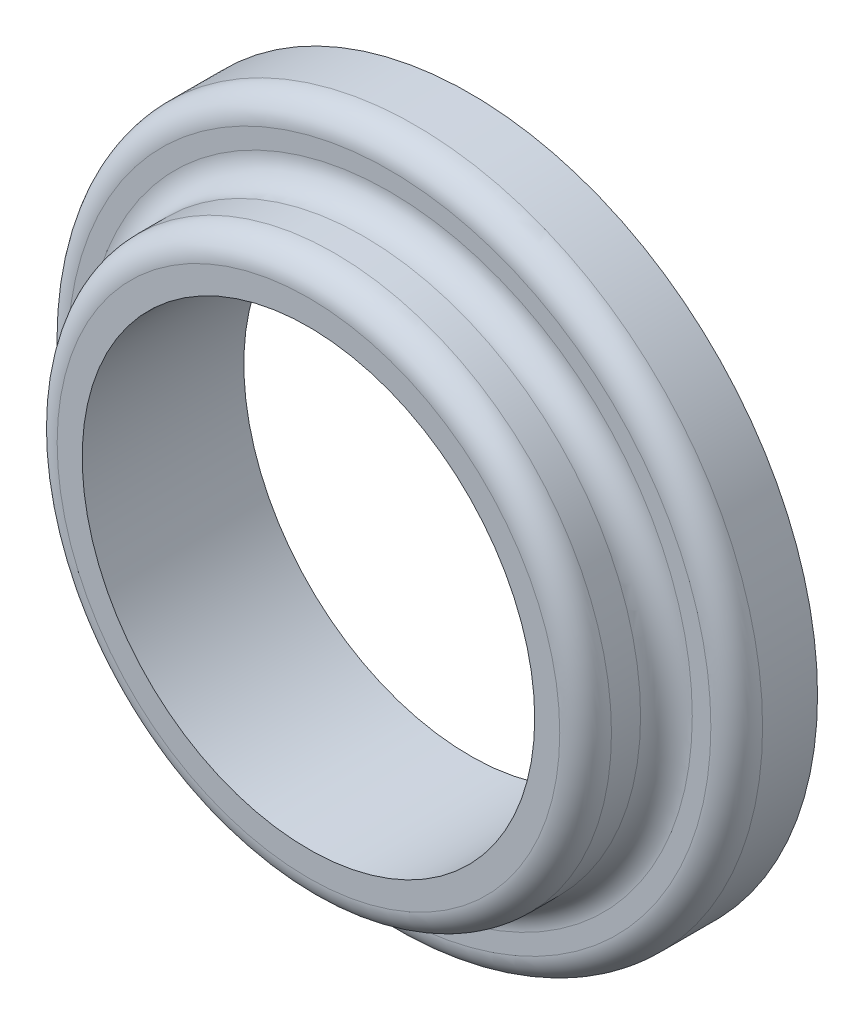
ISO-10303-21;
HEADER;
FILE_DESCRIPTION(('STEP AP214'),'2;1');
FILE_NAME('part.step','',(''),(''),'','','');
FILE_SCHEMA(('AUTOMOTIVE_DESIGN { 1 0 10303 214 1 1 1 1 }'));
ENDSEC;
DATA;
#1=APPLICATION_CONTEXT('core data for automotive mechanical design processes');
#2=APPLICATION_PROTOCOL_DEFINITION('international standard','automotive_design',2000,#1);
#3=PRODUCT_CONTEXT('',#1,'mechanical');
#4=PRODUCT('Part','Part','',(#3));
#5=PRODUCT_RELATED_PRODUCT_CATEGORY('part','',(#4));
#6=PRODUCT_DEFINITION_FORMATION('','',#4);
#7=PRODUCT_DEFINITION_CONTEXT('part definition',#1,'design');
#8=PRODUCT_DEFINITION('design','',#6,#7);
#9=PRODUCT_DEFINITION_SHAPE('','',#8);
#10=(LENGTH_UNIT() NAMED_UNIT(*) SI_UNIT(.MILLI.,.METRE.));
#11=(NAMED_UNIT(*) PLANE_ANGLE_UNIT() SI_UNIT($,.RADIAN.));
#12=(NAMED_UNIT(*) SI_UNIT($,.STERADIAN.) SOLID_ANGLE_UNIT());
#13=UNCERTAINTY_MEASURE_WITH_UNIT(LENGTH_MEASURE(1.E-05),#10,'distance_accuracy_value','');
#14=(GEOMETRIC_REPRESENTATION_CONTEXT(3) GLOBAL_UNCERTAINTY_ASSIGNED_CONTEXT((#13)) GLOBAL_UNIT_ASSIGNED_CONTEXT((#10,
#11,#12)) REPRESENTATION_CONTEXT('',''));
#15=CARTESIAN_POINT('',(0.,0.,0.));
#16=DIRECTION('',(0.,0.,1.));
#17=DIRECTION('',(1.,0.,0.));
#18=AXIS2_PLACEMENT_3D('',#15,#16,#17);
#19=CARTESIAN_POINT('',(-6.731,-165.719229699861,1.58750000000002));
#20=DIRECTION('',(0.,0.,1.));
#21=DIRECTION('',(1.,0.,0.));
#22=AXIS2_PLACEMENT_3D('',#19,#20,#21);
#23=PLANE('',#22);
#24=CARTESIAN_POINT('',(-6.731,-165.719229699861,1.58750000000002));
#25=DIRECTION('',(0.,0.,1.));
#26=DIRECTION('',(1.,0.,0.));
#27=AXIS2_PLACEMENT_3D('',#24,#25,#26);
#28=CIRCLE('',#27,5.953);
#29=CARTESIAN_POINT('',(-0.777999999999997,-165.719229699861,1.58750000000002));
#30=VERTEX_POINT('',#29);
#31=EDGE_CURVE('E47',#30,#30,#28,.F.);
#32=ORIENTED_EDGE('',*,*,#31,.T.);
#33=EDGE_LOOP('',(#32));
#34=FACE_BOUND('',#33,.T.);
#35=CARTESIAN_POINT('',(-6.731,-165.719229699861,1.58750000000002));
#36=DIRECTION('',(0.,0.,1.));
#37=DIRECTION('',(1.,0.,0.));
#38=AXIS2_PLACEMENT_3D('',#35,#36,#37);
#39=CIRCLE('',#38,6.31825);
#40=CARTESIAN_POINT('',(-0.412749999999996,-165.719229699861,1.58750000000002));
#41=VERTEX_POINT('',#40);
#42=EDGE_CURVE('E51',#41,#41,#39,.T.);
#43=ORIENTED_EDGE('',*,*,#42,.T.);
#44=EDGE_LOOP('',(#43));
#45=FACE_BOUND('',#44,.T.);
#46=ADVANCED_FACE('F40',(#34,#45),#23,.T.);
#47=CARTESIAN_POINT('',(-6.731,-165.719229699861,0.));
#48=DIRECTION('',(0.,0.,1.));
#49=DIRECTION('',(1.,0.,0.));
#50=AXIS2_PLACEMENT_3D('',#47,#48,#49);
#51=PLANE('',#50);
#52=CARTESIAN_POINT('',(-6.731,-165.719229699861,0.));
#53=DIRECTION('',(0.,0.,1.));
#54=DIRECTION('',(1.,0.,0.));
#55=AXIS2_PLACEMENT_3D('',#52,#53,#54);
#56=CIRCLE('',#55,6.82625);
#57=CARTESIAN_POINT('',(0.0952500000000033,-165.719229699861,0.));
#58=VERTEX_POINT('',#57);
#59=EDGE_CURVE('E66',#58,#58,#56,.T.);
#60=ORIENTED_EDGE('',*,*,#59,.F.);
#61=EDGE_LOOP('',(#60));
#62=FACE_BOUND('',#61,.T.);
#63=CARTESIAN_POINT('',(-6.731,-165.719229699861,0.));
#64=DIRECTION('',(0.,0.,1.));
#65=DIRECTION('',(1.,0.,0.));
#66=AXIS2_PLACEMENT_3D('',#63,#64,#65);
#67=CIRCLE('',#66,4.445);
#68=CARTESIAN_POINT('',(-2.286,-165.719229699861,0.));
#69=VERTEX_POINT('',#68);
#70=EDGE_CURVE('E69',#69,#69,#67,.T.);
#71=ORIENTED_EDGE('',*,*,#70,.T.);
#72=EDGE_LOOP('',(#71));
#73=FACE_BOUND('',#72,.T.);
#74=ADVANCED_FACE('F94',(#62,#73),#51,.F.);
#75=CARTESIAN_POINT('',(-6.731,-165.719229699861,1.58750000000002));
#76=DIRECTION('',(0.,0.,-1.));
#77=DIRECTION('',(-1.,0.,0.));
#78=AXIS2_PLACEMENT_3D('',#75,#76,#77);
#79=CYLINDRICAL_SURFACE('',#78,6.82625);
#80=CARTESIAN_POINT('',(-6.731,-165.719229699861,1.07950000000001));
#81=DIRECTION('',(0.,0.,1.));
#82=DIRECTION('',(1.,0.,0.));
#83=AXIS2_PLACEMENT_3D('',#80,#81,#82);
#84=CIRCLE('',#83,6.82625);
#85=CARTESIAN_POINT('',(0.0952500000000033,-165.719229699861,1.07950000000001));
#86=VERTEX_POINT('',#85);
#87=EDGE_CURVE('E11',#86,#86,#84,.F.);
#88=ORIENTED_EDGE('',*,*,#87,.T.);
#89=EDGE_LOOP('',(#88));
#90=FACE_BOUND('',#89,.T.);
#91=ORIENTED_EDGE('',*,*,#59,.T.);
#92=EDGE_LOOP('',(#91));
#93=FACE_BOUND('',#92,.T.);
#94=ADVANCED_FACE('F90',(#90,#93),#79,.T.);
#95=CARTESIAN_POINT('',(-6.731,-165.719229699861,1.58750000000002));
#96=DIRECTION('',(0.,0.,-1.));
#97=DIRECTION('',(-1.,0.,0.));
#98=AXIS2_PLACEMENT_3D('',#95,#96,#97);
#99=CYLINDRICAL_SURFACE('',#98,4.445);
#100=ORIENTED_EDGE('',*,*,#70,.F.);
#101=EDGE_LOOP('',(#100));
#102=FACE_BOUND('',#101,.T.);
#103=CARTESIAN_POINT('',(-6.731,-165.719229699861,3.17499999999998));
#104=DIRECTION('',(0.,0.,1.));
#105=DIRECTION('',(1.,0.,0.));
#106=AXIS2_PLACEMENT_3D('',#103,#104,#105);
#107=CIRCLE('',#106,4.445);
#108=CARTESIAN_POINT('',(-2.286,-165.719229699861,3.17499999999998));
#109=VERTEX_POINT('',#108);
#110=EDGE_CURVE('E72',#109,#109,#107,.T.);
#111=ORIENTED_EDGE('',*,*,#110,.T.);
#112=EDGE_LOOP('',(#111));
#113=FACE_BOUND('',#112,.T.);
#114=ADVANCED_FACE('F76',(#102,#113),#99,.F.);
#115=CARTESIAN_POINT('',(-6.731,-165.719229699861,3.17499999999998));
#116=DIRECTION('',(0.,0.,1.));
#117=DIRECTION('',(1.,0.,0.));
#118=AXIS2_PLACEMENT_3D('',#115,#116,#117);
#119=PLANE('',#118);
#120=CARTESIAN_POINT('',(-6.731,-165.719229699861,3.17499999999998));
#121=DIRECTION('',(0.,0.,1.));
#122=DIRECTION('',(1.,0.,0.));
#123=AXIS2_PLACEMENT_3D('',#120,#121,#122);
#124=CIRCLE('',#123,4.937);
#125=CARTESIAN_POINT('',(-1.794,-165.719229699861,3.17499999999998));
#126=VERTEX_POINT('',#125);
#127=EDGE_CURVE('E63',#126,#126,#124,.T.);
#128=ORIENTED_EDGE('',*,*,#127,.T.);
#129=EDGE_LOOP('',(#128));
#130=FACE_BOUND('',#129,.T.);
#131=ORIENTED_EDGE('',*,*,#110,.F.);
#132=EDGE_LOOP('',(#131));
#133=FACE_BOUND('',#132,.T.);
#134=ADVANCED_FACE('F78',(#130,#133),#119,.T.);
#135=CARTESIAN_POINT('',(-6.731,-165.719229699861,3.17499999999998));
#136=DIRECTION('',(0.,0.,-1.));
#137=DIRECTION('',(-1.,0.,0.));
#138=AXIS2_PLACEMENT_3D('',#135,#136,#137);
#139=CYLINDRICAL_SURFACE('',#138,5.445);
#140=CARTESIAN_POINT('',(-6.731,-165.719229699861,2.66699999999997));
#141=DIRECTION('',(0.,0.,1.));
#142=DIRECTION('',(1.,0.,0.));
#143=AXIS2_PLACEMENT_3D('',#140,#141,#142);
#144=CIRCLE('',#143,5.445);
#145=CARTESIAN_POINT('',(-1.286,-165.719229699861,2.66699999999997));
#146=VERTEX_POINT('',#145);
#147=EDGE_CURVE('E55',#146,#146,#144,.F.);
#148=ORIENTED_EDGE('',*,*,#147,.T.);
#149=EDGE_LOOP('',(#148));
#150=FACE_BOUND('',#149,.T.);
#151=CARTESIAN_POINT('',(-6.731,-165.719229699861,2.09550000000003));
#152=DIRECTION('',(0.,0.,1.));
#153=DIRECTION('',(1.,0.,0.));
#154=AXIS2_PLACEMENT_3D('',#151,#152,#153);
#155=CIRCLE('',#154,5.445);
#156=CARTESIAN_POINT('',(-1.286,-165.719229699861,2.09550000000003));
#157=VERTEX_POINT('',#156);
#158=EDGE_CURVE('E60',#157,#157,#155,.T.);
#159=ORIENTED_EDGE('',*,*,#158,.T.);
#160=EDGE_LOOP('',(#159));
#161=FACE_BOUND('',#160,.T.);
#162=ADVANCED_FACE('F80',(#150,#161),#139,.T.);
#163=CARTESIAN_POINT('',(-6.731,-165.719229699861,2.66699999999997));
#164=DIRECTION('',(0.,0.,1.));
#165=DIRECTION('',(1.,0.,0.));
#166=AXIS2_PLACEMENT_3D('',#163,#164,#165);
#167=TOROIDAL_SURFACE('',#166,4.937,0.508);
#168=ORIENTED_EDGE('',*,*,#147,.F.);
#169=EDGE_LOOP('',(#168));
#170=FACE_BOUND('',#169,.T.);
#171=ORIENTED_EDGE('',*,*,#127,.F.);
#172=EDGE_LOOP('',(#171));
#173=FACE_BOUND('',#172,.T.);
#174=ADVANCED_FACE('F87',(#170,#173),#167,.T.);
#175=CARTESIAN_POINT('',(-6.731,-165.719229699861,2.09550000000003));
#176=DIRECTION('',(0.,0.,1.));
#177=DIRECTION('',(1.,0.,0.));
#178=AXIS2_PLACEMENT_3D('',#175,#176,#177);
#179=TOROIDAL_SURFACE('',#178,5.953,0.508);
#180=ORIENTED_EDGE('',*,*,#31,.F.);
#181=EDGE_LOOP('',(#180));
#182=FACE_BOUND('',#181,.T.);
#183=ORIENTED_EDGE('',*,*,#158,.F.);
#184=EDGE_LOOP('',(#183));
#185=FACE_BOUND('',#184,.T.);
#186=ADVANCED_FACE('F106',(#182,#185),#179,.F.);
#187=CARTESIAN_POINT('',(-6.731,-165.719229699861,1.07950000000001));
#188=DIRECTION('',(0.,0.,1.));
#189=DIRECTION('',(1.,0.,0.));
#190=AXIS2_PLACEMENT_3D('',#187,#188,#189);
#191=TOROIDAL_SURFACE('',#190,6.31825,0.508);
#192=ORIENTED_EDGE('',*,*,#87,.F.);
#193=EDGE_LOOP('',(#192));
#194=FACE_BOUND('',#193,.T.);
#195=ORIENTED_EDGE('',*,*,#42,.F.);
#196=EDGE_LOOP('',(#195));
#197=FACE_BOUND('',#196,.T.);
#198=ADVANCED_FACE('F42',(#194,#197),#191,.T.);
#199=CLOSED_SHELL('',(#46,#74,#94,#114,#134,#162,#174,#186,#198));
#200=MANIFOLD_SOLID_BREP('B2',#199);
#201=ADVANCED_BREP_SHAPE_REPRESENTATION('',(#18,#200),#14);
#202=SHAPE_DEFINITION_REPRESENTATION(#9,#201);
ENDSEC;
END-ISO-10303-21;
